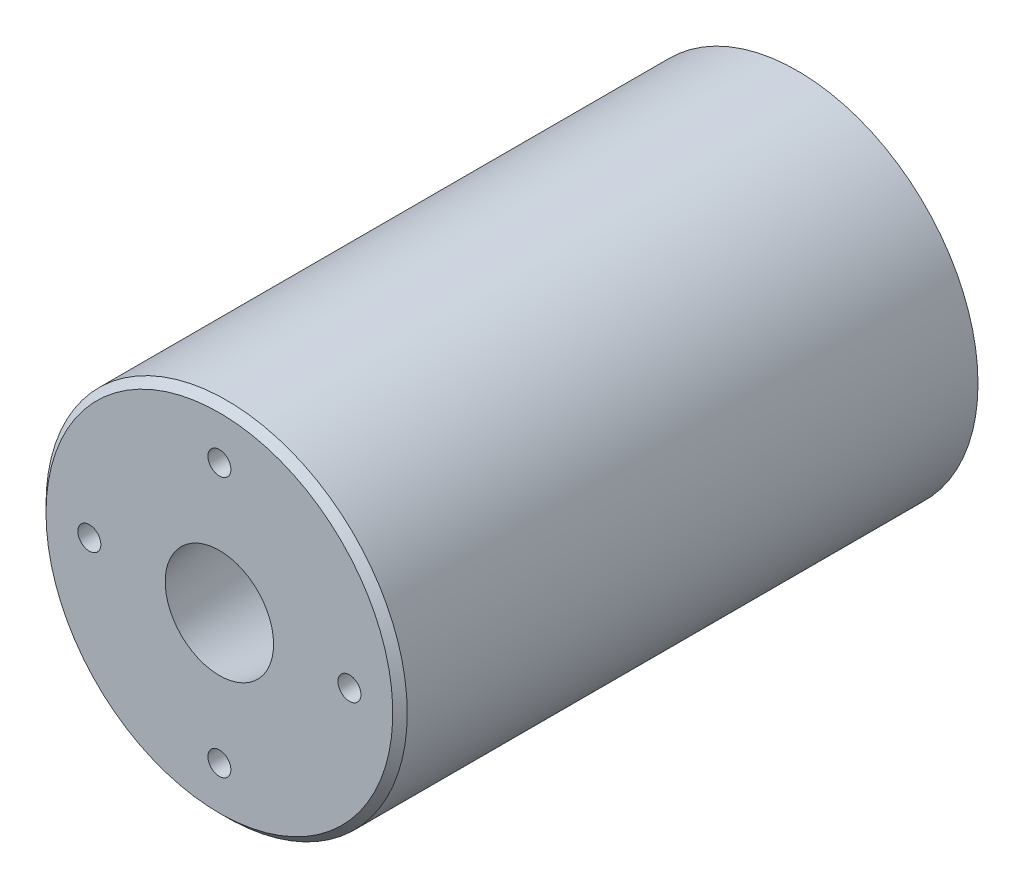
ISO-10303-21;
HEADER;
FILE_DESCRIPTION(('STEP AP214'),'2;1');
FILE_NAME('part.step','',(''),(''),'','','');
FILE_SCHEMA(('AUTOMOTIVE_DESIGN { 1 0 10303 214 1 1 1 1 }'));
ENDSEC;
DATA;
#1=APPLICATION_CONTEXT('core data for automotive mechanical design processes');
#2=APPLICATION_PROTOCOL_DEFINITION('international standard','automotive_design',2000,#1);
#3=PRODUCT_CONTEXT('',#1,'mechanical');
#4=PRODUCT('Part','Part','',(#3));
#5=PRODUCT_RELATED_PRODUCT_CATEGORY('part','',(#4));
#6=PRODUCT_DEFINITION_FORMATION('','',#4);
#7=PRODUCT_DEFINITION_CONTEXT('part definition',#1,'design');
#8=PRODUCT_DEFINITION('design','',#6,#7);
#9=PRODUCT_DEFINITION_SHAPE('','',#8);
#10=(LENGTH_UNIT() NAMED_UNIT(*) SI_UNIT(.MILLI.,.METRE.));
#11=(NAMED_UNIT(*) PLANE_ANGLE_UNIT() SI_UNIT($,.RADIAN.));
#12=(NAMED_UNIT(*) SI_UNIT($,.STERADIAN.) SOLID_ANGLE_UNIT());
#13=UNCERTAINTY_MEASURE_WITH_UNIT(LENGTH_MEASURE(1.E-05),#10,'distance_accuracy_value','');
#14=(GEOMETRIC_REPRESENTATION_CONTEXT(3) GLOBAL_UNCERTAINTY_ASSIGNED_CONTEXT((#13)) GLOBAL_UNIT_ASSIGNED_CONTEXT((#10,
#11,#12)) REPRESENTATION_CONTEXT('',''));
#15=CARTESIAN_POINT('',(0.,0.,0.));
#16=DIRECTION('',(0.,0.,1.));
#17=DIRECTION('',(1.,0.,0.));
#18=AXIS2_PLACEMENT_3D('',#15,#16,#17);
#19=CARTESIAN_POINT('',(0.,31.75,0.));
#20=DIRECTION('',(0.,0.,-1.));
#21=DIRECTION('',(-1.,0.,0.));
#22=AXIS2_PLACEMENT_3D('',#19,#20,#21);
#23=PLANE('',#22);
#24=CARTESIAN_POINT('',(0.,0.,0.));
#25=DIRECTION('',(0.,0.,-1.));
#26=DIRECTION('',(-1.,0.,0.));
#27=AXIS2_PLACEMENT_3D('',#24,#25,#26);
#28=CIRCLE('',#27,30.48);
#29=CARTESIAN_POINT('',(-30.48,0.,0.));
#30=VERTEX_POINT('',#29);
#31=EDGE_CURVE('E47',#30,#30,#28,.F.);
#32=ORIENTED_EDGE('',*,*,#31,.T.);
#33=EDGE_LOOP('',(#32));
#34=FACE_BOUND('',#33,.T.);
#35=CARTESIAN_POINT('',(0.,22.86,0.));
#36=DIRECTION('',(0.,0.,1.));
#37=DIRECTION('',(1.,0.,0.));
#38=AXIS2_PLACEMENT_3D('',#35,#36,#37);
#39=CIRCLE('',#38,2.01929999999999);
#40=CARTESIAN_POINT('',(2.01929999999999,22.86,0.));
#41=VERTEX_POINT('',#40);
#42=EDGE_CURVE('E71',#41,#41,#39,.T.);
#43=ORIENTED_EDGE('',*,*,#42,.F.);
#44=EDGE_LOOP('',(#43));
#45=FACE_BOUND('',#44,.T.);
#46=CARTESIAN_POINT('',(22.8600000000006,6.46920734996185E-13,0.));
#47=DIRECTION('',(0.,0.,1.));
#48=DIRECTION('',(1.,0.,0.));
#49=AXIS2_PLACEMENT_3D('',#46,#47,#48);
#50=CIRCLE('',#49,2.01929999999999);
#51=CARTESIAN_POINT('',(24.8793000000006,6.46920734996185E-13,0.));
#52=VERTEX_POINT('',#51);
#53=EDGE_CURVE('E70',#52,#52,#50,.T.);
#54=ORIENTED_EDGE('',*,*,#53,.F.);
#55=EDGE_LOOP('',(#54));
#56=FACE_BOUND('',#55,.T.);
#57=CARTESIAN_POINT('',(1.29384146999237E-12,-22.86,0.));
#58=DIRECTION('',(0.,0.,1.));
#59=DIRECTION('',(1.,0.,0.));
#60=AXIS2_PLACEMENT_3D('',#57,#58,#59);
#61=CIRCLE('',#60,2.01929999999999);
#62=CARTESIAN_POINT('',(2.01930000000128,-22.86,0.));
#63=VERTEX_POINT('',#62);
#64=EDGE_CURVE('E81',#63,#63,#61,.T.);
#65=ORIENTED_EDGE('',*,*,#64,.F.);
#66=EDGE_LOOP('',(#65));
#67=FACE_BOUND('',#66,.T.);
#68=CARTESIAN_POINT('',(-22.8599999999994,-6.44121192413334E-13,0.));
#69=DIRECTION('',(0.,0.,1.));
#70=DIRECTION('',(1.,0.,0.));
#71=AXIS2_PLACEMENT_3D('',#68,#69,#70);
#72=CIRCLE('',#71,2.01929999999999);
#73=CARTESIAN_POINT('',(-20.8406999999994,-6.44121192413334E-13,0.));
#74=VERTEX_POINT('',#73);
#75=EDGE_CURVE('E87',#74,#74,#72,.T.);
#76=ORIENTED_EDGE('',*,*,#75,.F.);
#77=EDGE_LOOP('',(#76));
#78=FACE_BOUND('',#77,.T.);
#79=CARTESIAN_POINT('',(0.,0.,0.));
#80=DIRECTION('',(0.,0.,1.));
#81=DIRECTION('',(1.,0.,0.));
#82=AXIS2_PLACEMENT_3D('',#79,#80,#81);
#83=CIRCLE('',#82,9.525);
#84=CARTESIAN_POINT('',(9.525,0.,0.));
#85=VERTEX_POINT('',#84);
#86=EDGE_CURVE('E93',#85,#85,#83,.T.);
#87=ORIENTED_EDGE('',*,*,#86,.F.);
#88=EDGE_LOOP('',(#87));
#89=FACE_BOUND('',#88,.T.);
#90=ADVANCED_FACE('F39',(#34,#45,#56,#67,#78,#89),#23,.F.);
#91=CARTESIAN_POINT('',(0.,0.,60.9332251335668));
#92=DIRECTION('',(0.,0.,1.));
#93=DIRECTION('',(1.,0.,0.));
#94=AXIS2_PLACEMENT_3D('',#91,#92,#93);
#95=CYLINDRICAL_SURFACE('',#94,31.75);
#96=CARTESIAN_POINT('',(0.,0.,-1.27));
#97=DIRECTION('',(0.,0.,-1.));
#98=DIRECTION('',(-1.,0.,0.));
#99=AXIS2_PLACEMENT_3D('',#96,#97,#98);
#100=CIRCLE('',#99,31.75);
#101=CARTESIAN_POINT('',(-31.75,0.,-1.27));
#102=VERTEX_POINT('',#101);
#103=EDGE_CURVE('E11',#102,#102,#100,.T.);
#104=ORIENTED_EDGE('',*,*,#103,.T.);
#105=EDGE_LOOP('',(#104));
#106=FACE_BOUND('',#105,.T.);
#107=CARTESIAN_POINT('',(0.,0.,-101.6));
#108=DIRECTION('',(0.,0.,1.));
#109=DIRECTION('',(1.,0.,0.));
#110=AXIS2_PLACEMENT_3D('',#107,#108,#109);
#111=CIRCLE('',#110,31.75);
#112=CARTESIAN_POINT('',(31.75,0.,-101.6));
#113=VERTEX_POINT('',#112);
#114=EDGE_CURVE('E99',#113,#113,#111,.T.);
#115=ORIENTED_EDGE('',*,*,#114,.T.);
#116=EDGE_LOOP('',(#115));
#117=FACE_BOUND('',#116,.T.);
#118=ADVANCED_FACE('F114',(#106,#117),#95,.T.);
#119=CARTESIAN_POINT('',(0.,22.7076,-101.6));
#120=DIRECTION('',(0.,0.,1.));
#121=DIRECTION('',(1.,0.,0.));
#122=AXIS2_PLACEMENT_3D('',#119,#120,#121);
#123=PLANE('',#122);
#124=ORIENTED_EDGE('',*,*,#114,.F.);
#125=EDGE_LOOP('',(#124));
#126=FACE_BOUND('',#125,.T.);
#127=CARTESIAN_POINT('',(0.,0.,-101.6));
#128=DIRECTION('',(0.,0.,1.));
#129=DIRECTION('',(1.,0.,0.));
#130=AXIS2_PLACEMENT_3D('',#127,#128,#129);
#131=CIRCLE('',#130,22.7076);
#132=CARTESIAN_POINT('',(22.7076,0.,-101.6));
#133=VERTEX_POINT('',#132);
#134=EDGE_CURVE('E96',#133,#133,#131,.T.);
#135=ORIENTED_EDGE('',*,*,#134,.T.);
#136=EDGE_LOOP('',(#135));
#137=FACE_BOUND('',#136,.T.);
#138=ADVANCED_FACE('F118',(#126,#137),#123,.F.);
#139=CARTESIAN_POINT('',(0.,0.,0.));
#140=DIRECTION('',(0.,0.,-1.));
#141=DIRECTION('',(-1.,0.,0.));
#142=AXIS2_PLACEMENT_3D('',#139,#140,#141);
#143=CONICAL_SURFACE('',#142,9.525,0.12902915097981);
#144=ORIENTED_EDGE('',*,*,#134,.F.);
#145=EDGE_LOOP('',(#144));
#146=FACE_BOUND('',#145,.T.);
#147=ORIENTED_EDGE('',*,*,#86,.T.);
#148=EDGE_LOOP('',(#147));
#149=FACE_BOUND('',#148,.T.);
#150=ADVANCED_FACE('F124',(#146,#149),#143,.F.);
#151=CARTESIAN_POINT('',(-22.8599999999994,-6.44121192413334E-13,-50.8));
#152=DIRECTION('',(0.,0.,1.));
#153=DIRECTION('',(1.,0.,0.));
#154=AXIS2_PLACEMENT_3D('',#151,#152,#153);
#155=CONICAL_SURFACE('',#154,2.01929999999999,1.02974425867665);
#156=CARTESIAN_POINT('',(-22.8599999999994,-6.44121192413334E-13,-52.0133178480024));
#157=VERTEX_POINT('',#156);
#158=VERTEX_LOOP('',#157);
#159=FACE_BOUND('',#158,.T.);
#160=CARTESIAN_POINT('',(-22.8599999999994,-6.44121192413334E-13,-50.8));
#161=DIRECTION('',(0.,0.,1.));
#162=DIRECTION('',(1.,0.,0.));
#163=AXIS2_PLACEMENT_3D('',#160,#161,#162);
#164=CIRCLE('',#163,2.01929999999999);
#165=CARTESIAN_POINT('',(-20.8406999999994,-6.44121192413334E-13,-50.8));
#166=VERTEX_POINT('',#165);
#167=EDGE_CURVE('E90',#166,#166,#164,.T.);
#168=ORIENTED_EDGE('',*,*,#167,.T.);
#169=EDGE_LOOP('',(#168));
#170=FACE_BOUND('',#169,.T.);
#171=ADVANCED_FACE('F128',(#159,#170),#155,.F.);
#172=CARTESIAN_POINT('',(-22.8599999999994,-6.44121192413334E-13,0.));
#173=DIRECTION('',(0.,0.,1.));
#174=DIRECTION('',(1.,0.,0.));
#175=AXIS2_PLACEMENT_3D('',#172,#173,#174);
#176=CYLINDRICAL_SURFACE('',#175,2.01929999999999);
#177=ORIENTED_EDGE('',*,*,#167,.F.);
#178=EDGE_LOOP('',(#177));
#179=FACE_BOUND('',#178,.T.);
#180=ORIENTED_EDGE('',*,*,#75,.T.);
#181=EDGE_LOOP('',(#180));
#182=FACE_BOUND('',#181,.T.);
#183=ADVANCED_FACE('F132',(#179,#182),#176,.F.);
#184=CARTESIAN_POINT('',(1.29384146999237E-12,-22.86,-50.8));
#185=DIRECTION('',(0.,0.,1.));
#186=DIRECTION('',(1.,0.,0.));
#187=AXIS2_PLACEMENT_3D('',#184,#185,#186);
#188=CONICAL_SURFACE('',#187,2.01929999999999,1.02974425867665);
#189=CARTESIAN_POINT('',(1.28110188134925E-12,-22.86,-52.0133178480024));
#190=VERTEX_POINT('',#189);
#191=VERTEX_LOOP('',#190);
#192=FACE_BOUND('',#191,.T.);
#193=CARTESIAN_POINT('',(1.29384146999237E-12,-22.86,-50.8));
#194=DIRECTION('',(0.,0.,1.));
#195=DIRECTION('',(1.,0.,0.));
#196=AXIS2_PLACEMENT_3D('',#193,#194,#195);
#197=CIRCLE('',#196,2.01929999999999);
#198=CARTESIAN_POINT('',(2.01930000000128,-22.86,-50.8));
#199=VERTEX_POINT('',#198);
#200=EDGE_CURVE('E84',#199,#199,#197,.T.);
#201=ORIENTED_EDGE('',*,*,#200,.T.);
#202=EDGE_LOOP('',(#201));
#203=FACE_BOUND('',#202,.T.);
#204=ADVANCED_FACE('F135',(#192,#203),#188,.F.);
#205=CARTESIAN_POINT('',(1.29384146999237E-12,-22.86,0.));
#206=DIRECTION('',(0.,0.,1.));
#207=DIRECTION('',(1.,0.,0.));
#208=AXIS2_PLACEMENT_3D('',#205,#206,#207);
#209=CYLINDRICAL_SURFACE('',#208,2.01929999999999);
#210=ORIENTED_EDGE('',*,*,#200,.F.);
#211=EDGE_LOOP('',(#210));
#212=FACE_BOUND('',#211,.T.);
#213=ORIENTED_EDGE('',*,*,#64,.T.);
#214=EDGE_LOOP('',(#213));
#215=FACE_BOUND('',#214,.T.);
#216=ADVANCED_FACE('F139',(#212,#215),#209,.F.);
#217=CARTESIAN_POINT('',(22.8600000000006,6.46920734996185E-13,-50.8));
#218=DIRECTION('',(0.,0.,1.));
#219=DIRECTION('',(1.,0.,0.));
#220=AXIS2_PLACEMENT_3D('',#217,#218,#219);
#221=CONICAL_SURFACE('',#220,2.01929999999999,1.02974425867665);
#222=CARTESIAN_POINT('',(22.8600000000006,6.46920734996185E-13,-52.0133178480024));
#223=VERTEX_POINT('',#222);
#224=VERTEX_LOOP('',#223);
#225=FACE_BOUND('',#224,.T.);
#226=CARTESIAN_POINT('',(22.8600000000006,6.46920734996185E-13,-50.8));
#227=DIRECTION('',(0.,0.,1.));
#228=DIRECTION('',(1.,0.,0.));
#229=AXIS2_PLACEMENT_3D('',#226,#227,#228);
#230=CIRCLE('',#229,2.01929999999999);
#231=CARTESIAN_POINT('',(24.8793000000006,6.46920734996185E-13,-50.8));
#232=VERTEX_POINT('',#231);
#233=EDGE_CURVE('E74',#232,#232,#230,.T.);
#234=ORIENTED_EDGE('',*,*,#233,.T.);
#235=EDGE_LOOP('',(#234));
#236=FACE_BOUND('',#235,.T.);
#237=ADVANCED_FACE('F142',(#225,#236),#221,.F.);
#238=CARTESIAN_POINT('',(22.8600000000006,6.46920734996185E-13,0.));
#239=DIRECTION('',(0.,0.,1.));
#240=DIRECTION('',(1.,0.,0.));
#241=AXIS2_PLACEMENT_3D('',#238,#239,#240);
#242=CYLINDRICAL_SURFACE('',#241,2.01929999999999);
#243=ORIENTED_EDGE('',*,*,#233,.F.);
#244=EDGE_LOOP('',(#243));
#245=FACE_BOUND('',#244,.T.);
#246=ORIENTED_EDGE('',*,*,#53,.T.);
#247=EDGE_LOOP('',(#246));
#248=FACE_BOUND('',#247,.T.);
#249=ADVANCED_FACE('F64',(#245,#248),#242,.F.);
#250=CARTESIAN_POINT('',(0.,22.86,-50.8));
#251=DIRECTION('',(0.,0.,1.));
#252=DIRECTION('',(1.,0.,0.));
#253=AXIS2_PLACEMENT_3D('',#250,#251,#252);
#254=CONICAL_SURFACE('',#253,2.01929999999999,1.02974425867665);
#255=CARTESIAN_POINT('',(0.,22.86,-52.0133178480024));
#256=VERTEX_POINT('',#255);
#257=VERTEX_LOOP('',#256);
#258=FACE_BOUND('',#257,.T.);
#259=CARTESIAN_POINT('',(0.,22.86,-50.8));
#260=DIRECTION('',(0.,0.,1.));
#261=DIRECTION('',(1.,0.,0.));
#262=AXIS2_PLACEMENT_3D('',#259,#260,#261);
#263=CIRCLE('',#262,2.01929999999999);
#264=CARTESIAN_POINT('',(2.01929999999999,22.86,-50.8));
#265=VERTEX_POINT('',#264);
#266=EDGE_CURVE('E68',#265,#265,#263,.T.);
#267=ORIENTED_EDGE('',*,*,#266,.T.);
#268=EDGE_LOOP('',(#267));
#269=FACE_BOUND('',#268,.T.);
#270=ADVANCED_FACE('F60',(#258,#269),#254,.F.);
#271=CARTESIAN_POINT('',(0.,22.86,0.));
#272=DIRECTION('',(0.,0.,1.));
#273=DIRECTION('',(1.,0.,0.));
#274=AXIS2_PLACEMENT_3D('',#271,#272,#273);
#275=CYLINDRICAL_SURFACE('',#274,2.01929999999999);
#276=ORIENTED_EDGE('',*,*,#266,.F.);
#277=EDGE_LOOP('',(#276));
#278=FACE_BOUND('',#277,.T.);
#279=ORIENTED_EDGE('',*,*,#42,.T.);
#280=EDGE_LOOP('',(#279));
#281=FACE_BOUND('',#280,.T.);
#282=ADVANCED_FACE('F63',(#278,#281),#275,.F.);
#283=CARTESIAN_POINT('',(0.,0.,0.));
#284=DIRECTION('',(0.,0.,-1.));
#285=DIRECTION('',(-1.,0.,0.));
#286=AXIS2_PLACEMENT_3D('',#283,#284,#285);
#287=CONICAL_SURFACE('',#286,30.48,0.785398163397446);
#288=ORIENTED_EDGE('',*,*,#103,.F.);
#289=EDGE_LOOP('',(#288));
#290=FACE_BOUND('',#289,.T.);
#291=ORIENTED_EDGE('',*,*,#31,.F.);
#292=EDGE_LOOP('',(#291));
#293=FACE_BOUND('',#292,.T.);
#294=ADVANCED_FACE('F41',(#290,#293),#287,.T.);
#295=CLOSED_SHELL('',(#90,#118,#138,#150,#171,#183,#204,#216,#237,#249,#270,#282,#294));
#296=MANIFOLD_SOLID_BREP('B2',#295);
#297=ADVANCED_BREP_SHAPE_REPRESENTATION('',(#18,#296),#14);
#298=SHAPE_DEFINITION_REPRESENTATION(#9,#297);
ENDSEC;
END-ISO-10303-21;
